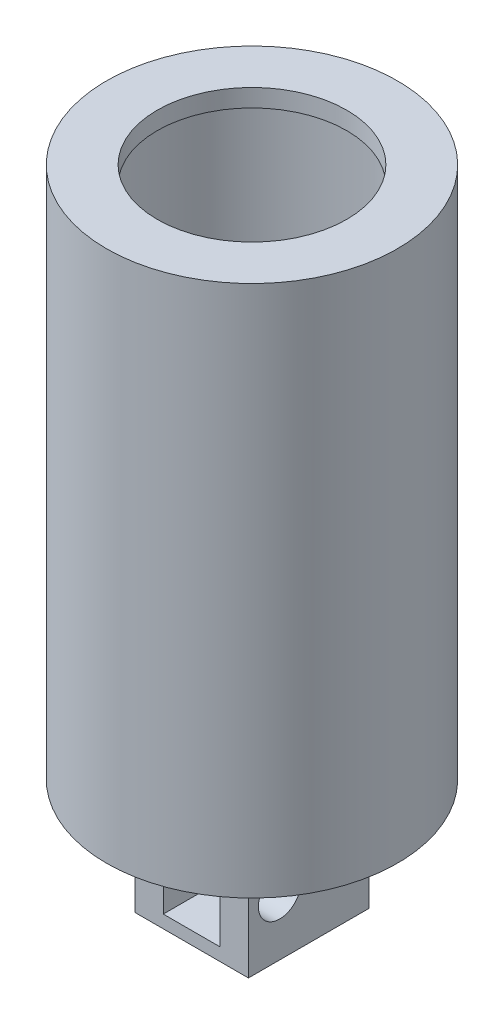
ISO-10303-21;
HEADER;
FILE_DESCRIPTION(('STEP AP214'),'2;1');
FILE_NAME('part.step','',(''),(''),'','','');
FILE_SCHEMA(('AUTOMOTIVE_DESIGN { 1 0 10303 214 1 1 1 1 }'));
ENDSEC;
DATA;
#1=APPLICATION_CONTEXT('core data for automotive mechanical design processes');
#2=APPLICATION_PROTOCOL_DEFINITION('international standard','automotive_design',2000,#1);
#3=PRODUCT_CONTEXT('',#1,'mechanical');
#4=PRODUCT('Part','Part','',(#3));
#5=PRODUCT_RELATED_PRODUCT_CATEGORY('part','',(#4));
#6=PRODUCT_DEFINITION_FORMATION('','',#4);
#7=PRODUCT_DEFINITION_CONTEXT('part definition',#1,'design');
#8=PRODUCT_DEFINITION('design','',#6,#7);
#9=PRODUCT_DEFINITION_SHAPE('','',#8);
#10=(LENGTH_UNIT() NAMED_UNIT(*) SI_UNIT(.MILLI.,.METRE.));
#11=(NAMED_UNIT(*) PLANE_ANGLE_UNIT() SI_UNIT($,.RADIAN.));
#12=(NAMED_UNIT(*) SI_UNIT($,.STERADIAN.) SOLID_ANGLE_UNIT());
#13=UNCERTAINTY_MEASURE_WITH_UNIT(LENGTH_MEASURE(1.E-05),#10,'distance_accuracy_value','');
#14=(GEOMETRIC_REPRESENTATION_CONTEXT(3) GLOBAL_UNCERTAINTY_ASSIGNED_CONTEXT((#13)) GLOBAL_UNIT_ASSIGNED_CONTEXT((#10,
#11,#12)) REPRESENTATION_CONTEXT('',''));
#15=CARTESIAN_POINT('',(0.,0.,0.));
#16=DIRECTION('',(0.,0.,1.));
#17=DIRECTION('',(1.,0.,0.));
#18=AXIS2_PLACEMENT_3D('',#15,#16,#17);
#19=CARTESIAN_POINT('',(0.,-37.5,0.));
#20=DIRECTION('',(0.,-1.,0.));
#21=DIRECTION('',(0.,0.,-1.));
#22=AXIS2_PLACEMENT_3D('',#19,#20,#21);
#23=PLANE('',#22);
#24=CARTESIAN_POINT('',(0.,-37.5,0.));
#25=DIRECTION('',(0.,-1.,0.));
#26=DIRECTION('',(0.,0.,-1.));
#27=AXIS2_PLACEMENT_3D('',#24,#25,#26);
#28=CIRCLE('',#27,10.25);
#29=CARTESIAN_POINT('',(0.,-37.5,-10.25));
#30=VERTEX_POINT('',#29);
#31=EDGE_CURVE('E170',#30,#30,#28,.T.);
#32=ORIENTED_EDGE('',*,*,#31,.T.);
#33=EDGE_LOOP('',(#32));
#34=FACE_BOUND('',#33,.T.);
#35=DIRECTION('',(1.,0.,0.));
#36=VECTOR('',#35,1.);
#37=CARTESIAN_POINT('',(-4.,-37.5,-4.25));
#38=LINE('',#37,#36);
#39=CARTESIAN_POINT('',(-4.,-37.5,-4.25));
#40=VERTEX_POINT('',#39);
#41=CARTESIAN_POINT('',(4.,-37.5,-4.25));
#42=VERTEX_POINT('',#41);
#43=EDGE_CURVE('E157',#40,#42,#38,.T.);
#44=ORIENTED_EDGE('',*,*,#43,.F.);
#45=DIRECTION('',(0.,0.,-1.));
#46=VECTOR('',#45,1.);
#47=CARTESIAN_POINT('',(-4.,-37.5,-4.25));
#48=LINE('',#47,#46);
#49=CARTESIAN_POINT('',(-4.,-37.5,4.25));
#50=VERTEX_POINT('',#49);
#51=EDGE_CURVE('E119',#50,#40,#48,.T.);
#52=ORIENTED_EDGE('',*,*,#51,.F.);
#53=DIRECTION('',(-1.,0.,0.));
#54=VECTOR('',#53,1.);
#55=CARTESIAN_POINT('',(-4.,-37.5,4.25));
#56=LINE('',#55,#54);
#57=CARTESIAN_POINT('',(4.,-37.5,4.25));
#58=VERTEX_POINT('',#57);
#59=EDGE_CURVE('E148',#58,#50,#56,.T.);
#60=ORIENTED_EDGE('',*,*,#59,.F.);
#61=DIRECTION('',(0.,0.,1.));
#62=VECTOR('',#61,1.);
#63=CARTESIAN_POINT('',(4.,-37.5,4.25));
#64=LINE('',#63,#62);
#65=EDGE_CURVE('E159',#42,#58,#64,.T.);
#66=ORIENTED_EDGE('',*,*,#65,.F.);
#67=EDGE_LOOP('',(#44,#52,#60,#66));
#68=FACE_BOUND('',#67,.T.);
#69=ADVANCED_FACE('F33',(#34,#68),#23,.T.);
#70=CARTESIAN_POINT('',(-6.6742077453173,-1.25,0.));
#71=DIRECTION('',(0.,-1.,0.));
#72=DIRECTION('',(0.,0.,-1.));
#73=AXIS2_PLACEMENT_3D('',#70,#71,#72);
#74=PLANE('',#73);
#75=CARTESIAN_POINT('',(0.,-1.25,0.));
#76=DIRECTION('',(0.,1.,0.));
#77=DIRECTION('',(0.,0.,1.));
#78=AXIS2_PLACEMENT_3D('',#75,#76,#77);
#79=CIRCLE('',#78,6.67420774531728);
#80=CARTESIAN_POINT('',(0.,-1.25,6.67420774531728));
#81=VERTEX_POINT('',#80);
#82=EDGE_CURVE('E11',#81,#81,#79,.T.);
#83=ORIENTED_EDGE('',*,*,#82,.T.);
#84=EDGE_LOOP('',(#83));
#85=FACE_BOUND('',#84,.T.);
#86=CARTESIAN_POINT('',(0.,-1.25,0.));
#87=DIRECTION('',(0.,1.,0.));
#88=DIRECTION('',(0.,0.,1.));
#89=AXIS2_PLACEMENT_3D('',#86,#87,#88);
#90=CIRCLE('',#89,9.);
#91=CARTESIAN_POINT('',(0.,-1.25,9.));
#92=VERTEX_POINT('',#91);
#93=EDGE_CURVE('E173',#92,#92,#90,.T.);
#94=ORIENTED_EDGE('',*,*,#93,.F.);
#95=EDGE_LOOP('',(#94));
#96=FACE_BOUND('',#95,.T.);
#97=ADVANCED_FACE('F35',(#85,#96),#74,.T.);
#98=CARTESIAN_POINT('',(0.,9.2780196486332,0.));
#99=DIRECTION('',(0.,1.,0.));
#100=DIRECTION('',(0.,0.,1.));
#101=AXIS2_PLACEMENT_3D('',#98,#99,#100);
#102=CYLINDRICAL_SURFACE('',#101,6.67420774531728);
#103=CARTESIAN_POINT('',(0.,0.,0.));
#104=DIRECTION('',(0.,1.,0.));
#105=DIRECTION('',(0.,0.,1.));
#106=AXIS2_PLACEMENT_3D('',#103,#104,#105);
#107=CIRCLE('',#106,6.67420774531728);
#108=CARTESIAN_POINT('',(0.,0.,6.67420774531728));
#109=VERTEX_POINT('',#108);
#110=EDGE_CURVE('E41',#109,#109,#107,.T.);
#111=ORIENTED_EDGE('',*,*,#110,.T.);
#112=EDGE_LOOP('',(#111));
#113=FACE_BOUND('',#112,.T.);
#114=ORIENTED_EDGE('',*,*,#82,.F.);
#115=EDGE_LOOP('',(#114));
#116=FACE_BOUND('',#115,.T.);
#117=ADVANCED_FACE('F184',(#113,#116),#102,.F.);
#118=CARTESIAN_POINT('',(-6.6742077453173,0.,0.));
#119=DIRECTION('',(0.,1.,0.));
#120=DIRECTION('',(0.,0.,1.));
#121=AXIS2_PLACEMENT_3D('',#118,#119,#120);
#122=PLANE('',#121);
#123=CARTESIAN_POINT('',(0.,0.,0.));
#124=DIRECTION('',(0.,1.,0.));
#125=DIRECTION('',(0.,0.,1.));
#126=AXIS2_PLACEMENT_3D('',#123,#124,#125);
#127=CIRCLE('',#126,10.25);
#128=CARTESIAN_POINT('',(0.,0.,10.25));
#129=VERTEX_POINT('',#128);
#130=EDGE_CURVE('E179',#129,#129,#127,.T.);
#131=ORIENTED_EDGE('',*,*,#130,.T.);
#132=EDGE_LOOP('',(#131));
#133=FACE_BOUND('',#132,.T.);
#134=ORIENTED_EDGE('',*,*,#110,.F.);
#135=EDGE_LOOP('',(#134));
#136=FACE_BOUND('',#135,.T.);
#137=ADVANCED_FACE('F187',(#133,#136),#122,.T.);
#138=CARTESIAN_POINT('',(0.,9.2780196486332,0.));
#139=DIRECTION('',(0.,1.,0.));
#140=DIRECTION('',(0.,0.,1.));
#141=AXIS2_PLACEMENT_3D('',#138,#139,#140);
#142=CYLINDRICAL_SURFACE('',#141,10.25);
#143=ORIENTED_EDGE('',*,*,#130,.F.);
#144=EDGE_LOOP('',(#143));
#145=FACE_BOUND('',#144,.T.);
#146=ORIENTED_EDGE('',*,*,#31,.F.);
#147=EDGE_LOOP('',(#146));
#148=FACE_BOUND('',#147,.T.);
#149=ADVANCED_FACE('F189',(#145,#148),#142,.T.);
#150=CARTESIAN_POINT('',(0.,9.2780196486332,0.));
#151=DIRECTION('',(0.,1.,0.));
#152=DIRECTION('',(0.,0.,1.));
#153=AXIS2_PLACEMENT_3D('',#150,#151,#152);
#154=CYLINDRICAL_SURFACE('',#153,9.);
#155=ORIENTED_EDGE('',*,*,#93,.T.);
#156=EDGE_LOOP('',(#155));
#157=FACE_BOUND('',#156,.T.);
#158=CARTESIAN_POINT('',(0.,-36.5,0.));
#159=DIRECTION('',(0.,1.,0.));
#160=DIRECTION('',(0.,0.,1.));
#161=AXIS2_PLACEMENT_3D('',#158,#159,#160);
#162=CIRCLE('',#161,8.99999999999999);
#163=CARTESIAN_POINT('',(0.,-36.5,8.99999999999999));
#164=VERTEX_POINT('',#163);
#165=EDGE_CURVE('E176',#164,#164,#162,.T.);
#166=ORIENTED_EDGE('',*,*,#165,.F.);
#167=EDGE_LOOP('',(#166));
#168=FACE_BOUND('',#167,.T.);
#169=ADVANCED_FACE('F196',(#157,#168),#154,.F.);
#170=CARTESIAN_POINT('',(0.,-36.5,0.));
#171=DIRECTION('',(0.,-1.,0.));
#172=DIRECTION('',(0.,0.,-1.));
#173=AXIS2_PLACEMENT_3D('',#170,#171,#172);
#174=PLANE('',#173);
#175=ORIENTED_EDGE('',*,*,#165,.T.);
#176=EDGE_LOOP('',(#175));
#177=FACE_BOUND('',#176,.T.);
#178=ADVANCED_FACE('F211',(#177),#174,.F.);
#179=CARTESIAN_POINT('',(-4.,-45.5,-4.25));
#180=DIRECTION('',(1.,0.,0.));
#181=DIRECTION('',(0.,0.,-1.));
#182=AXIS2_PLACEMENT_3D('',#179,#180,#181);
#183=PLANE('',#182);
#184=CARTESIAN_POINT('',(-4.,-41.5,2.05));
#185=DIRECTION('',(1.,0.,0.));
#186=DIRECTION('',(0.,0.,-1.));
#187=AXIS2_PLACEMENT_3D('',#184,#185,#186);
#188=CIRCLE('',#187,1.5);
#189=CARTESIAN_POINT('',(-4.,-41.5,0.549999999999995));
#190=VERTEX_POINT('',#189);
#191=EDGE_CURVE('E387',#190,#190,#188,.T.);
#192=ORIENTED_EDGE('',*,*,#191,.T.);
#193=EDGE_LOOP('',(#192));
#194=FACE_BOUND('',#193,.T.);
#195=ORIENTED_EDGE('',*,*,#51,.T.);
#196=DIRECTION('',(0.,1.,0.));
#197=VECTOR('',#196,1.);
#198=CARTESIAN_POINT('',(-4.,-45.5,-4.25));
#199=LINE('',#198,#197);
#200=CARTESIAN_POINT('',(-4.,-45.5,-4.25));
#201=VERTEX_POINT('',#200);
#202=EDGE_CURVE('E168',#201,#40,#199,.T.);
#203=ORIENTED_EDGE('',*,*,#202,.F.);
#204=DIRECTION('',(0.,0.,-1.));
#205=VECTOR('',#204,1.);
#206=CARTESIAN_POINT('',(-4.,-45.5,-4.25));
#207=LINE('',#206,#205);
#208=CARTESIAN_POINT('',(-4.,-45.5,4.25));
#209=VERTEX_POINT('',#208);
#210=EDGE_CURVE('E144',#209,#201,#207,.T.);
#211=ORIENTED_EDGE('',*,*,#210,.F.);
#212=DIRECTION('',(0.,1.,0.));
#213=VECTOR('',#212,1.);
#214=CARTESIAN_POINT('',(-4.,-45.5,4.25));
#215=LINE('',#214,#213);
#216=EDGE_CURVE('E154',#209,#50,#215,.T.);
#217=ORIENTED_EDGE('',*,*,#216,.T.);
#218=EDGE_LOOP('',(#195,#203,#211,#217));
#219=FACE_BOUND('',#218,.T.);
#220=ADVANCED_FACE('F209',(#194,#219),#183,.F.);
#221=CARTESIAN_POINT('',(-4.,-45.5,-4.25));
#222=DIRECTION('',(0.,0.,1.));
#223=DIRECTION('',(1.,0.,0.));
#224=AXIS2_PLACEMENT_3D('',#221,#222,#223);
#225=PLANE('',#224);
#226=ORIENTED_EDGE('',*,*,#43,.T.);
#227=DIRECTION('',(0.,1.,0.));
#228=VECTOR('',#227,1.);
#229=CARTESIAN_POINT('',(4.,-45.5,-4.25));
#230=LINE('',#229,#228);
#231=CARTESIAN_POINT('',(4.,-45.5,-4.25));
#232=VERTEX_POINT('',#231);
#233=EDGE_CURVE('E165',#232,#42,#230,.T.);
#234=ORIENTED_EDGE('',*,*,#233,.F.);
#235=DIRECTION('',(1.,0.,0.));
#236=VECTOR('',#235,1.);
#237=CARTESIAN_POINT('',(-4.,-45.5,-4.25));
#238=LINE('',#237,#236);
#239=EDGE_CURVE('E147',#201,#232,#238,.T.);
#240=ORIENTED_EDGE('',*,*,#239,.F.);
#241=ORIENTED_EDGE('',*,*,#202,.T.);
#242=EDGE_LOOP('',(#226,#234,#240,#241));
#243=FACE_BOUND('',#242,.T.);
#244=ADVANCED_FACE('F235',(#243),#225,.F.);
#245=CARTESIAN_POINT('',(4.,-45.5,4.25));
#246=DIRECTION('',(-1.,0.,0.));
#247=DIRECTION('',(0.,0.,1.));
#248=AXIS2_PLACEMENT_3D('',#245,#246,#247);
#249=PLANE('',#248);
#250=CARTESIAN_POINT('',(4.00000000000001,-41.5,2.05));
#251=DIRECTION('',(1.,0.,0.));
#252=DIRECTION('',(0.,0.,-1.));
#253=AXIS2_PLACEMENT_3D('',#250,#251,#252);
#254=CIRCLE('',#253,1.5);
#255=CARTESIAN_POINT('',(4.00000000000001,-41.5,0.549999999999997));
#256=VERTEX_POINT('',#255);
#257=EDGE_CURVE('E382',#256,#256,#254,.F.);
#258=ORIENTED_EDGE('',*,*,#257,.T.);
#259=EDGE_LOOP('',(#258));
#260=FACE_BOUND('',#259,.T.);
#261=ORIENTED_EDGE('',*,*,#65,.T.);
#262=DIRECTION('',(0.,1.,0.));
#263=VECTOR('',#262,1.);
#264=CARTESIAN_POINT('',(4.,-45.5,4.25));
#265=LINE('',#264,#263);
#266=CARTESIAN_POINT('',(4.,-45.5,4.25));
#267=VERTEX_POINT('',#266);
#268=EDGE_CURVE('E56',#267,#58,#265,.T.);
#269=ORIENTED_EDGE('',*,*,#268,.F.);
#270=DIRECTION('',(0.,0.,1.));
#271=VECTOR('',#270,1.);
#272=CARTESIAN_POINT('',(4.,-45.5,4.25));
#273=LINE('',#272,#271);
#274=EDGE_CURVE('E150',#232,#267,#273,.T.);
#275=ORIENTED_EDGE('',*,*,#274,.F.);
#276=ORIENTED_EDGE('',*,*,#233,.T.);
#277=EDGE_LOOP('',(#261,#269,#275,#276));
#278=FACE_BOUND('',#277,.T.);
#279=ADVANCED_FACE('F244',(#260,#278),#249,.F.);
#280=CARTESIAN_POINT('',(-4.,-45.5,4.25));
#281=DIRECTION('',(0.,0.,-1.));
#282=DIRECTION('',(-1.,0.,0.));
#283=AXIS2_PLACEMENT_3D('',#280,#281,#282);
#284=PLANE('',#283);
#285=DIRECTION('',(-1.,0.,0.));
#286=VECTOR('',#285,1.);
#287=CARTESIAN_POINT('',(2.00000000000001,-38.4,4.25));
#288=LINE('',#287,#286);
#289=CARTESIAN_POINT('',(2.00000000000001,-38.4,4.25));
#290=VERTEX_POINT('',#289);
#291=CARTESIAN_POINT('',(-1.99999999999999,-38.4,4.25));
#292=VERTEX_POINT('',#291);
#293=EDGE_CURVE('E124',#290,#292,#288,.T.);
#294=ORIENTED_EDGE('',*,*,#293,.F.);
#295=DIRECTION('',(0.,-1.,0.));
#296=VECTOR('',#295,1.);
#297=CARTESIAN_POINT('',(2.00000000000001,0.,4.25));
#298=LINE('',#297,#296);
#299=CARTESIAN_POINT('',(2.00000000000001,-44.6,4.25));
#300=VERTEX_POINT('',#299);
#301=EDGE_CURVE('E105',#290,#300,#298,.T.);
#302=ORIENTED_EDGE('',*,*,#301,.T.);
#303=DIRECTION('',(-1.,0.,0.));
#304=VECTOR('',#303,1.);
#305=CARTESIAN_POINT('',(2.00000000000001,-44.6,4.25));
#306=LINE('',#305,#304);
#307=CARTESIAN_POINT('',(-1.99999999999999,-44.6,4.25));
#308=VERTEX_POINT('',#307);
#309=EDGE_CURVE('E113',#300,#308,#306,.T.);
#310=ORIENTED_EDGE('',*,*,#309,.T.);
#311=DIRECTION('',(0.,-1.,0.));
#312=VECTOR('',#311,1.);
#313=CARTESIAN_POINT('',(-1.99999999999999,0.,4.25));
#314=LINE('',#313,#312);
#315=EDGE_CURVE('E135',#292,#308,#314,.T.);
#316=ORIENTED_EDGE('',*,*,#315,.F.);
#317=EDGE_LOOP('',(#294,#302,#310,#316));
#318=FACE_BOUND('',#317,.T.);
#319=ORIENTED_EDGE('',*,*,#59,.T.);
#320=ORIENTED_EDGE('',*,*,#216,.F.);
#321=DIRECTION('',(-1.,0.,0.));
#322=VECTOR('',#321,1.);
#323=CARTESIAN_POINT('',(-4.,-45.5,4.25));
#324=LINE('',#323,#322);
#325=EDGE_CURVE('E152',#267,#209,#324,.T.);
#326=ORIENTED_EDGE('',*,*,#325,.F.);
#327=ORIENTED_EDGE('',*,*,#268,.T.);
#328=EDGE_LOOP('',(#319,#320,#326,#327));
#329=FACE_BOUND('',#328,.T.);
#330=ADVANCED_FACE('F123',(#318,#329),#284,.F.);
#331=CARTESIAN_POINT('',(0.,-45.5,0.));
#332=DIRECTION('',(0.,1.,0.));
#333=DIRECTION('',(0.,0.,1.));
#334=AXIS2_PLACEMENT_3D('',#331,#332,#333);
#335=PLANE('',#334);
#336=ORIENTED_EDGE('',*,*,#210,.T.);
#337=ORIENTED_EDGE('',*,*,#239,.T.);
#338=ORIENTED_EDGE('',*,*,#274,.T.);
#339=ORIENTED_EDGE('',*,*,#325,.T.);
#340=EDGE_LOOP('',(#336,#337,#338,#339));
#341=FACE_BOUND('',#340,.T.);
#342=ADVANCED_FACE('F259',(#341),#335,.F.);
#343=CARTESIAN_POINT('',(2.00000000000001,-44.6,0.));
#344=DIRECTION('',(0.,1.,0.));
#345=DIRECTION('',(0.,0.,1.));
#346=AXIS2_PLACEMENT_3D('',#343,#344,#345);
#347=PLANE('',#346);
#348=DIRECTION('',(0.,0.,-1.));
#349=VECTOR('',#348,1.);
#350=CARTESIAN_POINT('',(-1.99999999999999,-44.6,0.));
#351=LINE('',#350,#349);
#352=CARTESIAN_POINT('',(-1.99999999999999,-44.6,-0.750000000000001));
#353=VERTEX_POINT('',#352);
#354=EDGE_CURVE('E116',#308,#353,#351,.T.);
#355=ORIENTED_EDGE('',*,*,#354,.F.);
#356=ORIENTED_EDGE('',*,*,#309,.F.);
#357=DIRECTION('',(0.,0.,-1.));
#358=VECTOR('',#357,1.);
#359=CARTESIAN_POINT('',(2.00000000000001,-44.6,0.));
#360=LINE('',#359,#358);
#361=CARTESIAN_POINT('',(2.00000000000001,-44.6,-0.75));
#362=VERTEX_POINT('',#361);
#363=EDGE_CURVE('E100',#300,#362,#360,.T.);
#364=ORIENTED_EDGE('',*,*,#363,.T.);
#365=DIRECTION('',(-1.,0.,0.));
#366=VECTOR('',#365,1.);
#367=CARTESIAN_POINT('',(2.00000000000001,-44.6,-0.75));
#368=LINE('',#367,#366);
#369=EDGE_CURVE('E120',#362,#353,#368,.T.);
#370=ORIENTED_EDGE('',*,*,#369,.T.);
#371=EDGE_LOOP('',(#355,#356,#364,#370));
#372=FACE_BOUND('',#371,.T.);
#373=ADVANCED_FACE('F114',(#372),#347,.T.);
#374=CARTESIAN_POINT('',(2.00000000000001,-41.5,-0.750000000000001));
#375=DIRECTION('',(-1.,0.,0.));
#376=DIRECTION('',(0.,0.,1.));
#377=AXIS2_PLACEMENT_3D('',#374,#375,#376);
#378=CYLINDRICAL_SURFACE('',#377,3.10000000000001);
#379=CARTESIAN_POINT('',(-1.99999999999999,-41.5,-0.750000000000002));
#380=DIRECTION('',(1.,0.,0.));
#381=DIRECTION('',(0.,0.,-1.));
#382=AXIS2_PLACEMENT_3D('',#379,#380,#381);
#383=CIRCLE('',#382,3.10000000000001);
#384=CARTESIAN_POINT('',(-1.99999999999999,-38.4,-0.750000000000004));
#385=VERTEX_POINT('',#384);
#386=EDGE_CURVE('E126',#385,#353,#383,.F.);
#387=ORIENTED_EDGE('',*,*,#386,.T.);
#388=ORIENTED_EDGE('',*,*,#369,.F.);
#389=CARTESIAN_POINT('',(2.00000000000001,-41.5,-0.750000000000001));
#390=DIRECTION('',(1.,0.,0.));
#391=DIRECTION('',(0.,0.,-1.));
#392=AXIS2_PLACEMENT_3D('',#389,#390,#391);
#393=CIRCLE('',#392,3.10000000000001);
#394=CARTESIAN_POINT('',(2.00000000000001,-38.4,-0.750000000000003));
#395=VERTEX_POINT('',#394);
#396=EDGE_CURVE('E108',#395,#362,#393,.F.);
#397=ORIENTED_EDGE('',*,*,#396,.F.);
#398=DIRECTION('',(-1.,0.,0.));
#399=VECTOR('',#398,1.);
#400=CARTESIAN_POINT('',(2.00000000000001,-38.4,-0.750000000000003));
#401=LINE('',#400,#399);
#402=EDGE_CURVE('E141',#395,#385,#401,.T.);
#403=ORIENTED_EDGE('',*,*,#402,.T.);
#404=EDGE_LOOP('',(#387,#388,#397,#403));
#405=FACE_BOUND('',#404,.T.);
#406=ADVANCED_FACE('F272',(#405),#378,.F.);
#407=CARTESIAN_POINT('',(2.00000000000001,-38.4,0.));
#408=DIRECTION('',(0.,1.,0.));
#409=DIRECTION('',(0.,0.,1.));
#410=AXIS2_PLACEMENT_3D('',#407,#408,#409);
#411=PLANE('',#410);
#412=DIRECTION('',(0.,0.,-1.));
#413=VECTOR('',#412,1.);
#414=CARTESIAN_POINT('',(-1.99999999999999,-38.4,0.));
#415=LINE('',#414,#413);
#416=EDGE_CURVE('E48',#292,#385,#415,.T.);
#417=ORIENTED_EDGE('',*,*,#416,.T.);
#418=ORIENTED_EDGE('',*,*,#402,.F.);
#419=DIRECTION('',(0.,0.,-1.));
#420=VECTOR('',#419,1.);
#421=CARTESIAN_POINT('',(2.00000000000001,-38.4,0.));
#422=LINE('',#421,#420);
#423=EDGE_CURVE('E133',#290,#395,#422,.T.);
#424=ORIENTED_EDGE('',*,*,#423,.F.);
#425=ORIENTED_EDGE('',*,*,#293,.T.);
#426=EDGE_LOOP('',(#417,#418,#424,#425));
#427=FACE_BOUND('',#426,.T.);
#428=ADVANCED_FACE('F279',(#427),#411,.F.);
#429=CARTESIAN_POINT('',(2.00000000000001,0.,0.));
#430=DIRECTION('',(1.,0.,0.));
#431=DIRECTION('',(0.,0.,-1.));
#432=AXIS2_PLACEMENT_3D('',#429,#430,#431);
#433=PLANE('',#432);
#434=CARTESIAN_POINT('',(2.00000000000001,-41.5,2.05));
#435=DIRECTION('',(1.,0.,0.));
#436=DIRECTION('',(0.,0.,-1.));
#437=AXIS2_PLACEMENT_3D('',#434,#435,#436);
#438=CIRCLE('',#437,1.5);
#439=CARTESIAN_POINT('',(2.00000000000001,-41.5,0.549999999999997));
#440=VERTEX_POINT('',#439);
#441=EDGE_CURVE('E129',#440,#440,#438,.F.);
#442=ORIENTED_EDGE('',*,*,#441,.F.);
#443=EDGE_LOOP('',(#442));
#444=FACE_BOUND('',#443,.T.);
#445=ORIENTED_EDGE('',*,*,#301,.F.);
#446=ORIENTED_EDGE('',*,*,#423,.T.);
#447=ORIENTED_EDGE('',*,*,#396,.T.);
#448=ORIENTED_EDGE('',*,*,#363,.F.);
#449=EDGE_LOOP('',(#445,#446,#447,#448));
#450=FACE_BOUND('',#449,.T.);
#451=ADVANCED_FACE('F102',(#444,#450),#433,.F.);
#452=CARTESIAN_POINT('',(-1.99999999999999,0.,0.));
#453=DIRECTION('',(1.,0.,0.));
#454=DIRECTION('',(0.,0.,-1.));
#455=AXIS2_PLACEMENT_3D('',#452,#453,#454);
#456=PLANE('',#455);
#457=CARTESIAN_POINT('',(-1.99999999999999,-41.5,2.05));
#458=DIRECTION('',(1.,0.,0.));
#459=DIRECTION('',(0.,0.,-1.));
#460=AXIS2_PLACEMENT_3D('',#457,#458,#459);
#461=CIRCLE('',#460,1.5);
#462=CARTESIAN_POINT('',(-1.99999999999999,-41.5,0.549999999999996));
#463=VERTEX_POINT('',#462);
#464=EDGE_CURVE('E385',#463,#463,#461,.F.);
#465=ORIENTED_EDGE('',*,*,#464,.T.);
#466=EDGE_LOOP('',(#465));
#467=FACE_BOUND('',#466,.T.);
#468=ORIENTED_EDGE('',*,*,#315,.T.);
#469=ORIENTED_EDGE('',*,*,#354,.T.);
#470=ORIENTED_EDGE('',*,*,#386,.F.);
#471=ORIENTED_EDGE('',*,*,#416,.F.);
#472=EDGE_LOOP('',(#468,#469,#470,#471));
#473=FACE_BOUND('',#472,.T.);
#474=ADVANCED_FACE('F294',(#467,#473),#456,.T.);
#475=CARTESIAN_POINT('',(-8.24264068711929,-41.5,2.05));
#476=DIRECTION('',(1.,0.,0.));
#477=DIRECTION('',(0.,0.,-1.));
#478=AXIS2_PLACEMENT_3D('',#475,#476,#477);
#479=CYLINDRICAL_SURFACE('',#478,1.5);
#480=ORIENTED_EDGE('',*,*,#464,.F.);
#481=EDGE_LOOP('',(#480));
#482=FACE_BOUND('',#481,.T.);
#483=ORIENTED_EDGE('',*,*,#191,.F.);
#484=EDGE_LOOP('',(#483));
#485=FACE_BOUND('',#484,.T.);
#486=ADVANCED_FACE('F301',(#482,#485),#479,.F.);
#487=ORIENTED_EDGE('',*,*,#257,.F.);
#488=EDGE_LOOP('',(#487));
#489=FACE_BOUND('',#488,.T.);
#490=ORIENTED_EDGE('',*,*,#441,.T.);
#491=EDGE_LOOP('',(#490));
#492=FACE_BOUND('',#491,.T.);
#493=ADVANCED_FACE('F308',(#489,#492),#479,.F.);
#494=CLOSED_SHELL('',(#69,#97,#117,#137,#149,#169,#178,#220,#244,#279,#330,#342,#373,#406,#428,
#451,#474,#486,#493));
#495=MANIFOLD_SOLID_BREP('B2',#494);
#496=ADVANCED_BREP_SHAPE_REPRESENTATION('',(#18,#495),#14);
#497=SHAPE_DEFINITION_REPRESENTATION(#9,#496);
ENDSEC;
END-ISO-10303-21;
